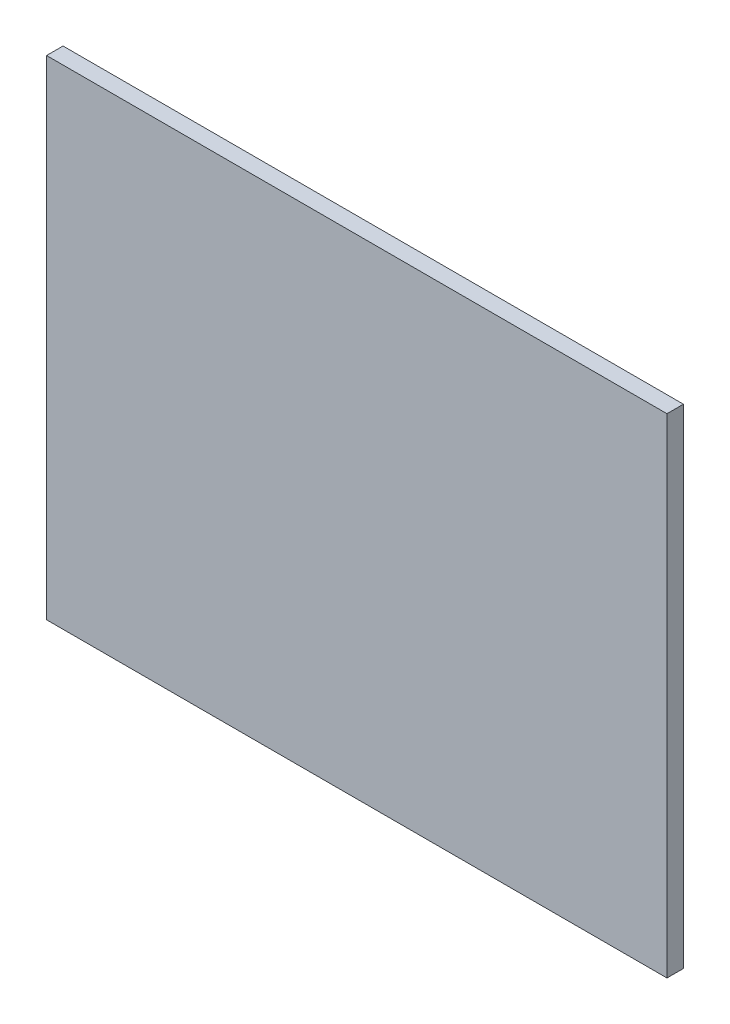
ISO-10303-21;
HEADER;
FILE_DESCRIPTION(('STEP AP214'),'2;1');
FILE_NAME('part.step','',(''),(''),'','','');
FILE_SCHEMA(('AUTOMOTIVE_DESIGN { 1 0 10303 214 1 1 1 1 }'));
ENDSEC;
DATA;
#1=APPLICATION_CONTEXT('core data for automotive mechanical design processes');
#2=APPLICATION_PROTOCOL_DEFINITION('international standard','automotive_design',2000,#1);
#3=PRODUCT_CONTEXT('',#1,'mechanical');
#4=PRODUCT('Part','Part','',(#3));
#5=PRODUCT_RELATED_PRODUCT_CATEGORY('part','',(#4));
#6=PRODUCT_DEFINITION_FORMATION('','',#4);
#7=PRODUCT_DEFINITION_CONTEXT('part definition',#1,'design');
#8=PRODUCT_DEFINITION('design','',#6,#7);
#9=PRODUCT_DEFINITION_SHAPE('','',#8);
#10=(LENGTH_UNIT() NAMED_UNIT(*) SI_UNIT(.MILLI.,.METRE.));
#11=(NAMED_UNIT(*) PLANE_ANGLE_UNIT() SI_UNIT($,.RADIAN.));
#12=(NAMED_UNIT(*) SI_UNIT($,.STERADIAN.) SOLID_ANGLE_UNIT());
#13=UNCERTAINTY_MEASURE_WITH_UNIT(LENGTH_MEASURE(1.E-05),#10,'distance_accuracy_value','');
#14=(GEOMETRIC_REPRESENTATION_CONTEXT(3) GLOBAL_UNCERTAINTY_ASSIGNED_CONTEXT((#13)) GLOBAL_UNIT_ASSIGNED_CONTEXT((#10,
#11,#12)) REPRESENTATION_CONTEXT('',''));
#15=CARTESIAN_POINT('',(0.,0.,0.));
#16=DIRECTION('',(0.,0.,1.));
#17=DIRECTION('',(1.,0.,0.));
#18=AXIS2_PLACEMENT_3D('',#15,#16,#17);
#19=CARTESIAN_POINT('',(-301.5,-237.5,16.));
#20=DIRECTION('',(1.,0.,0.));
#21=DIRECTION('',(0.,0.,-1.));
#22=AXIS2_PLACEMENT_3D('',#19,#20,#21);
#23=PLANE('',#22);
#24=DIRECTION('',(0.,-1.,0.));
#25=VECTOR('',#24,1.);
#26=CARTESIAN_POINT('',(-301.5,-237.5,0.));
#27=LINE('',#26,#25);
#28=CARTESIAN_POINT('',(-301.5,237.5,0.));
#29=VERTEX_POINT('',#28);
#30=CARTESIAN_POINT('',(-301.5,-237.5,0.));
#31=VERTEX_POINT('',#30);
#32=EDGE_CURVE('E95',#29,#31,#27,.T.);
#33=ORIENTED_EDGE('',*,*,#32,.T.);
#34=DIRECTION('',(0.,0.,-1.));
#35=VECTOR('',#34,1.);
#36=CARTESIAN_POINT('',(-301.5,-237.5,16.));
#37=LINE('',#36,#35);
#38=CARTESIAN_POINT('',(-301.5,-237.5,16.));
#39=VERTEX_POINT('',#38);
#40=EDGE_CURVE('E11',#39,#31,#37,.T.);
#41=ORIENTED_EDGE('',*,*,#40,.F.);
#42=DIRECTION('',(0.,-1.,0.));
#43=VECTOR('',#42,1.);
#44=CARTESIAN_POINT('',(-301.5,-237.5,16.));
#45=LINE('',#44,#43);
#46=CARTESIAN_POINT('',(-301.5,237.5,16.));
#47=VERTEX_POINT('',#46);
#48=EDGE_CURVE('E83',#47,#39,#45,.T.);
#49=ORIENTED_EDGE('',*,*,#48,.F.);
#50=DIRECTION('',(0.,0.,-1.));
#51=VECTOR('',#50,1.);
#52=CARTESIAN_POINT('',(-301.5,237.5,16.));
#53=LINE('',#52,#51);
#54=EDGE_CURVE('E91',#47,#29,#53,.T.);
#55=ORIENTED_EDGE('',*,*,#54,.T.);
#56=EDGE_LOOP('',(#33,#41,#49,#55));
#57=FACE_BOUND('',#56,.T.);
#58=ADVANCED_FACE('F32',(#57),#23,.F.);
#59=CARTESIAN_POINT('',(301.5,-237.5,16.));
#60=DIRECTION('',(0.,1.,0.));
#61=DIRECTION('',(-1.,0.,0.));
#62=AXIS2_PLACEMENT_3D('',#59,#60,#61);
#63=PLANE('',#62);
#64=DIRECTION('',(1.,0.,0.));
#65=VECTOR('',#64,1.);
#66=CARTESIAN_POINT('',(301.5,-237.5,0.));
#67=LINE('',#66,#65);
#68=CARTESIAN_POINT('',(301.5,-237.5,0.));
#69=VERTEX_POINT('',#68);
#70=EDGE_CURVE('E87',#31,#69,#67,.T.);
#71=ORIENTED_EDGE('',*,*,#70,.T.);
#72=DIRECTION('',(0.,0.,-1.));
#73=VECTOR('',#72,1.);
#74=CARTESIAN_POINT('',(301.5,-237.5,16.));
#75=LINE('',#74,#73);
#76=CARTESIAN_POINT('',(301.5,-237.5,16.));
#77=VERTEX_POINT('',#76);
#78=EDGE_CURVE('E40',#77,#69,#75,.T.);
#79=ORIENTED_EDGE('',*,*,#78,.F.);
#80=DIRECTION('',(1.,0.,0.));
#81=VECTOR('',#80,1.);
#82=CARTESIAN_POINT('',(301.5,-237.5,16.));
#83=LINE('',#82,#81);
#84=EDGE_CURVE('E78',#39,#77,#83,.T.);
#85=ORIENTED_EDGE('',*,*,#84,.F.);
#86=ORIENTED_EDGE('',*,*,#40,.T.);
#87=EDGE_LOOP('',(#71,#79,#85,#86));
#88=FACE_BOUND('',#87,.T.);
#89=ADVANCED_FACE('F86',(#88),#63,.F.);
#90=CARTESIAN_POINT('',(301.5,-237.5,16.));
#91=DIRECTION('',(-1.,0.,0.));
#92=DIRECTION('',(0.,-1.,0.));
#93=AXIS2_PLACEMENT_3D('',#90,#91,#92);
#94=PLANE('',#93);
#95=DIRECTION('',(0.,1.,0.));
#96=VECTOR('',#95,1.);
#97=CARTESIAN_POINT('',(301.5,-237.5,0.));
#98=LINE('',#97,#96);
#99=CARTESIAN_POINT('',(301.5,237.5,0.));
#100=VERTEX_POINT('',#99);
#101=EDGE_CURVE('E65',#69,#100,#98,.T.);
#102=ORIENTED_EDGE('',*,*,#101,.T.);
#103=DIRECTION('',(0.,0.,-1.));
#104=VECTOR('',#103,1.);
#105=CARTESIAN_POINT('',(301.5,237.5,16.));
#106=LINE('',#105,#104);
#107=CARTESIAN_POINT('',(301.5,237.5,16.));
#108=VERTEX_POINT('',#107);
#109=EDGE_CURVE('E88',#108,#100,#106,.T.);
#110=ORIENTED_EDGE('',*,*,#109,.F.);
#111=DIRECTION('',(0.,1.,0.));
#112=VECTOR('',#111,1.);
#113=CARTESIAN_POINT('',(301.5,-237.5,16.));
#114=LINE('',#113,#112);
#115=EDGE_CURVE('E81',#77,#108,#114,.T.);
#116=ORIENTED_EDGE('',*,*,#115,.F.);
#117=ORIENTED_EDGE('',*,*,#78,.T.);
#118=EDGE_LOOP('',(#102,#110,#116,#117));
#119=FACE_BOUND('',#118,.T.);
#120=ADVANCED_FACE('F89',(#119),#94,.F.);
#121=CARTESIAN_POINT('',(301.5,237.5,16.));
#122=DIRECTION('',(0.,-1.,0.));
#123=DIRECTION('',(1.,0.,0.));
#124=AXIS2_PLACEMENT_3D('',#121,#122,#123);
#125=PLANE('',#124);
#126=DIRECTION('',(-1.,0.,0.));
#127=VECTOR('',#126,1.);
#128=CARTESIAN_POINT('',(301.5,237.5,0.));
#129=LINE('',#128,#127);
#130=EDGE_CURVE('E71',#100,#29,#129,.T.);
#131=ORIENTED_EDGE('',*,*,#130,.T.);
#132=ORIENTED_EDGE('',*,*,#54,.F.);
#133=DIRECTION('',(-1.,0.,0.));
#134=VECTOR('',#133,1.);
#135=CARTESIAN_POINT('',(301.5,237.5,16.));
#136=LINE('',#135,#134);
#137=EDGE_CURVE('E48',#108,#47,#136,.T.);
#138=ORIENTED_EDGE('',*,*,#137,.F.);
#139=ORIENTED_EDGE('',*,*,#109,.T.);
#140=EDGE_LOOP('',(#131,#132,#138,#139));
#141=FACE_BOUND('',#140,.T.);
#142=ADVANCED_FACE('F102',(#141),#125,.F.);
#143=CARTESIAN_POINT('',(0.,0.,16.));
#144=DIRECTION('',(0.,0.,1.));
#145=DIRECTION('',(1.,0.,0.));
#146=AXIS2_PLACEMENT_3D('',#143,#144,#145);
#147=PLANE('',#146);
#148=ORIENTED_EDGE('',*,*,#48,.T.);
#149=ORIENTED_EDGE('',*,*,#84,.T.);
#150=ORIENTED_EDGE('',*,*,#115,.T.);
#151=ORIENTED_EDGE('',*,*,#137,.T.);
#152=EDGE_LOOP('',(#148,#149,#150,#151));
#153=FACE_BOUND('',#152,.T.);
#154=ADVANCED_FACE('F79',(#153),#147,.T.);
#155=CARTESIAN_POINT('',(0.,0.,0.));
#156=DIRECTION('',(0.,0.,1.));
#157=DIRECTION('',(1.,0.,0.));
#158=AXIS2_PLACEMENT_3D('',#155,#156,#157);
#159=PLANE('',#158);
#160=ORIENTED_EDGE('',*,*,#32,.F.);
#161=ORIENTED_EDGE('',*,*,#130,.F.);
#162=ORIENTED_EDGE('',*,*,#101,.F.);
#163=ORIENTED_EDGE('',*,*,#70,.F.);
#164=EDGE_LOOP('',(#160,#161,#162,#163));
#165=FACE_BOUND('',#164,.T.);
#166=ADVANCED_FACE('F105',(#165),#159,.F.);
#167=CLOSED_SHELL('',(#58,#89,#120,#142,#154,#166));
#168=MANIFOLD_SOLID_BREP('B2',#167);
#169=ADVANCED_BREP_SHAPE_REPRESENTATION('',(#18,#168),#14);
#170=SHAPE_DEFINITION_REPRESENTATION(#9,#169);
ENDSEC;
END-ISO-10303-21;
